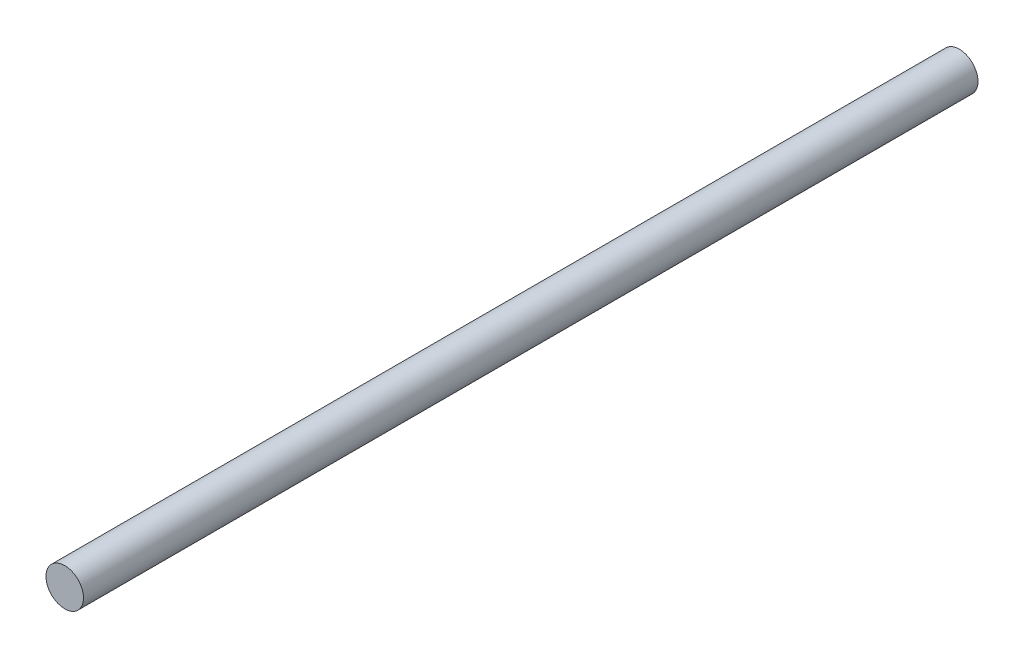
ISO-10303-21;
HEADER;
FILE_DESCRIPTION(('STEP AP214'),'2;1');
FILE_NAME('part.step','',(''),(''),'','','');
FILE_SCHEMA(('AUTOMOTIVE_DESIGN { 1 0 10303 214 1 1 1 1 }'));
ENDSEC;
DATA;
#1=APPLICATION_CONTEXT('core data for automotive mechanical design processes');
#2=APPLICATION_PROTOCOL_DEFINITION('international standard','automotive_design',2000,#1);
#3=PRODUCT_CONTEXT('',#1,'mechanical');
#4=PRODUCT('Part','Part','',(#3));
#5=PRODUCT_RELATED_PRODUCT_CATEGORY('part','',(#4));
#6=PRODUCT_DEFINITION_FORMATION('','',#4);
#7=PRODUCT_DEFINITION_CONTEXT('part definition',#1,'design');
#8=PRODUCT_DEFINITION('design','',#6,#7);
#9=PRODUCT_DEFINITION_SHAPE('','',#8);
#10=(LENGTH_UNIT() NAMED_UNIT(*) SI_UNIT(.MILLI.,.METRE.));
#11=(NAMED_UNIT(*) PLANE_ANGLE_UNIT() SI_UNIT($,.RADIAN.));
#12=(NAMED_UNIT(*) SI_UNIT($,.STERADIAN.) SOLID_ANGLE_UNIT());
#13=UNCERTAINTY_MEASURE_WITH_UNIT(LENGTH_MEASURE(1.E-05),#10,'distance_accuracy_value','');
#14=(GEOMETRIC_REPRESENTATION_CONTEXT(3) GLOBAL_UNCERTAINTY_ASSIGNED_CONTEXT((#13)) GLOBAL_UNIT_ASSIGNED_CONTEXT((#10,
#11,#12)) REPRESENTATION_CONTEXT('',''));
#15=CARTESIAN_POINT('',(0.,0.,0.));
#16=DIRECTION('',(0.,0.,1.));
#17=DIRECTION('',(1.,0.,0.));
#18=AXIS2_PLACEMENT_3D('',#15,#16,#17);
#19=CARTESIAN_POINT('',(0.,0.,151.384));
#20=DIRECTION('',(0.,0.,-1.));
#21=DIRECTION('',(-1.,0.,0.));
#22=AXIS2_PLACEMENT_3D('',#19,#20,#21);
#23=CYLINDRICAL_SURFACE('',#22,3.175);
#24=CARTESIAN_POINT('',(0.,0.,151.384));
#25=DIRECTION('',(0.,0.,1.));
#26=DIRECTION('',(1.,0.,0.));
#27=AXIS2_PLACEMENT_3D('',#24,#25,#26);
#28=CIRCLE('',#27,3.175);
#29=CARTESIAN_POINT('',(3.175,0.,151.384));
#30=VERTEX_POINT('',#29);
#31=EDGE_CURVE('E10',#30,#30,#28,.T.);
#32=ORIENTED_EDGE('',*,*,#31,.F.);
#33=EDGE_LOOP('',(#32));
#34=FACE_BOUND('',#33,.T.);
#35=CARTESIAN_POINT('',(0.,0.,0.));
#36=DIRECTION('',(0.,0.,1.));
#37=DIRECTION('',(1.,0.,0.));
#38=AXIS2_PLACEMENT_3D('',#35,#36,#37);
#39=CIRCLE('',#38,3.175);
#40=CARTESIAN_POINT('',(3.175,0.,0.));
#41=VERTEX_POINT('',#40);
#42=EDGE_CURVE('E35',#41,#41,#39,.T.);
#43=ORIENTED_EDGE('',*,*,#42,.T.);
#44=EDGE_LOOP('',(#43));
#45=FACE_BOUND('',#44,.T.);
#46=ADVANCED_FACE('F32',(#34,#45),#23,.T.);
#47=CARTESIAN_POINT('',(0.,0.,151.384));
#48=DIRECTION('',(0.,0.,1.));
#49=DIRECTION('',(1.,0.,0.));
#50=AXIS2_PLACEMENT_3D('',#47,#48,#49);
#51=PLANE('',#50);
#52=ORIENTED_EDGE('',*,*,#31,.T.);
#53=EDGE_LOOP('',(#52));
#54=FACE_BOUND('',#53,.T.);
#55=ADVANCED_FACE('F47',(#54),#51,.T.);
#56=CARTESIAN_POINT('',(0.,0.,0.));
#57=DIRECTION('',(0.,0.,1.));
#58=DIRECTION('',(1.,0.,0.));
#59=AXIS2_PLACEMENT_3D('',#56,#57,#58);
#60=PLANE('',#59);
#61=ORIENTED_EDGE('',*,*,#42,.F.);
#62=EDGE_LOOP('',(#61));
#63=FACE_BOUND('',#62,.T.);
#64=ADVANCED_FACE('F45',(#63),#60,.F.);
#65=CLOSED_SHELL('',(#46,#55,#64));
#66=MANIFOLD_SOLID_BREP('B2',#65);
#67=ADVANCED_BREP_SHAPE_REPRESENTATION('',(#18,#66),#14);
#68=SHAPE_DEFINITION_REPRESENTATION(#9,#67);
ENDSEC;
END-ISO-10303-21;
